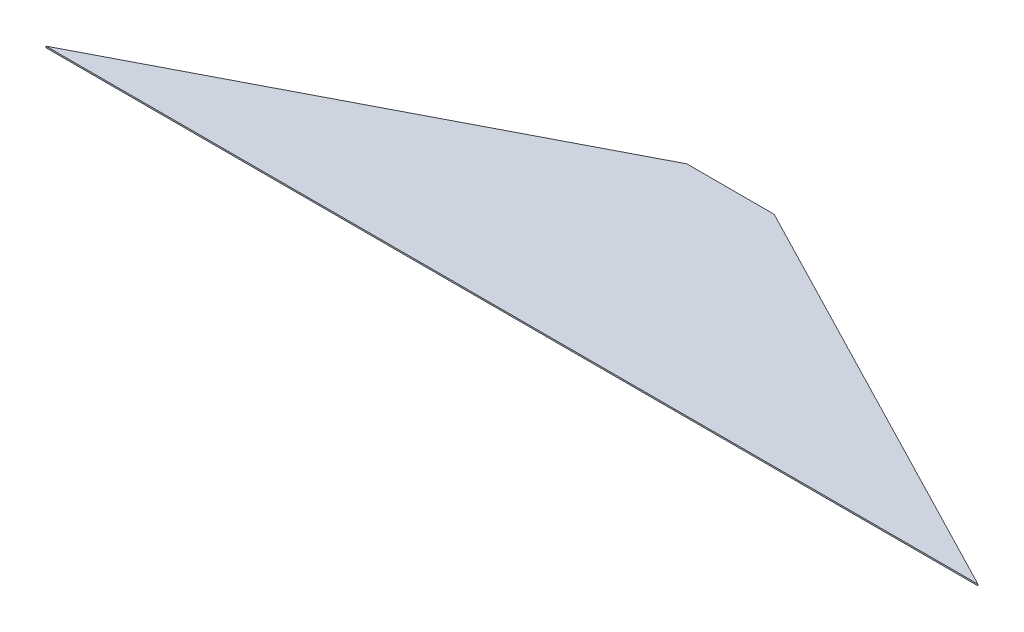
ISO-10303-21;
HEADER;
FILE_DESCRIPTION(('STEP AP214'),'2;1');
FILE_NAME('part.step','',(''),(''),'','','');
FILE_SCHEMA(('AUTOMOTIVE_DESIGN { 1 0 10303 214 1 1 1 1 }'));
ENDSEC;
DATA;
#1=APPLICATION_CONTEXT('core data for automotive mechanical design processes');
#2=APPLICATION_PROTOCOL_DEFINITION('international standard','automotive_design',2000,#1);
#3=PRODUCT_CONTEXT('',#1,'mechanical');
#4=PRODUCT('Part','Part','',(#3));
#5=PRODUCT_RELATED_PRODUCT_CATEGORY('part','',(#4));
#6=PRODUCT_DEFINITION_FORMATION('','',#4);
#7=PRODUCT_DEFINITION_CONTEXT('part definition',#1,'design');
#8=PRODUCT_DEFINITION('design','',#6,#7);
#9=PRODUCT_DEFINITION_SHAPE('','',#8);
#10=(LENGTH_UNIT() NAMED_UNIT(*) SI_UNIT(.MILLI.,.METRE.));
#11=(NAMED_UNIT(*) PLANE_ANGLE_UNIT() SI_UNIT($,.RADIAN.));
#12=(NAMED_UNIT(*) SI_UNIT($,.STERADIAN.) SOLID_ANGLE_UNIT());
#13=UNCERTAINTY_MEASURE_WITH_UNIT(LENGTH_MEASURE(1.E-05),#10,'distance_accuracy_value','');
#14=(GEOMETRIC_REPRESENTATION_CONTEXT(3) GLOBAL_UNCERTAINTY_ASSIGNED_CONTEXT((#13)) GLOBAL_UNIT_ASSIGNED_CONTEXT((#10,
#11,#12)) REPRESENTATION_CONTEXT('',''));
#15=CARTESIAN_POINT('',(0.,0.,0.));
#16=DIRECTION('',(0.,0.,1.));
#17=DIRECTION('',(1.,0.,0.));
#18=AXIS2_PLACEMENT_3D('',#15,#16,#17);
#19=CARTESIAN_POINT('',(290.,1.,-150.));
#20=DIRECTION('',(0.459422918873767,0.,0.888217643155949));
#21=DIRECTION('',(0.888217643155949,0.,-0.459422918873767));
#22=AXIS2_PLACEMENT_3D('',#19,#20,#21);
#23=PLANE('',#22);
#24=DIRECTION('',(-0.888217643155949,0.,0.459422918873767));
#25=VECTOR('',#24,1.);
#26=CARTESIAN_POINT('',(290.,0.,-150.));
#27=LINE('',#26,#25);
#28=CARTESIAN_POINT('',(290.,0.,-150.));
#29=VERTEX_POINT('',#28);
#30=CARTESIAN_POINT('',(0.,0.,0.));
#31=VERTEX_POINT('',#30);
#32=EDGE_CURVE('E107',#29,#31,#27,.T.);
#33=ORIENTED_EDGE('',*,*,#32,.T.);
#34=DIRECTION('',(0.,-1.,0.));
#35=VECTOR('',#34,1.);
#36=CARTESIAN_POINT('',(0.,1.,0.));
#37=LINE('',#36,#35);
#38=CARTESIAN_POINT('',(0.,1.,0.));
#39=VERTEX_POINT('',#38);
#40=EDGE_CURVE('E11',#39,#31,#37,.T.);
#41=ORIENTED_EDGE('',*,*,#40,.F.);
#42=DIRECTION('',(-0.888217643155949,0.,0.459422918873767));
#43=VECTOR('',#42,1.);
#44=CARTESIAN_POINT('',(290.,1.,-150.));
#45=LINE('',#44,#43);
#46=CARTESIAN_POINT('',(290.,1.,-150.));
#47=VERTEX_POINT('',#46);
#48=EDGE_CURVE('E91',#47,#39,#45,.T.);
#49=ORIENTED_EDGE('',*,*,#48,.F.);
#50=DIRECTION('',(0.,-1.,0.));
#51=VECTOR('',#50,1.);
#52=CARTESIAN_POINT('',(290.,1.,-150.));
#53=LINE('',#52,#51);
#54=EDGE_CURVE('E103',#47,#29,#53,.T.);
#55=ORIENTED_EDGE('',*,*,#54,.T.);
#56=EDGE_LOOP('',(#33,#41,#49,#55));
#57=FACE_BOUND('',#56,.T.);
#58=ADVANCED_FACE('F39',(#57),#23,.F.);
#59=CARTESIAN_POINT('',(0.,1.,0.));
#60=DIRECTION('',(0.,0.,-1.));
#61=DIRECTION('',(-1.,0.,0.));
#62=AXIS2_PLACEMENT_3D('',#59,#60,#61);
#63=PLANE('',#62);
#64=DIRECTION('',(1.,0.,0.));
#65=VECTOR('',#64,1.);
#66=CARTESIAN_POINT('',(0.,0.,0.));
#67=LINE('',#66,#65);
#68=CARTESIAN_POINT('',(640.,0.,0.));
#69=VERTEX_POINT('',#68);
#70=EDGE_CURVE('E96',#31,#69,#67,.T.);
#71=ORIENTED_EDGE('',*,*,#70,.T.);
#72=DIRECTION('',(0.,-1.,0.));
#73=VECTOR('',#72,1.);
#74=CARTESIAN_POINT('',(640.,1.,0.));
#75=LINE('',#74,#73);
#76=CARTESIAN_POINT('',(640.,1.,0.));
#77=VERTEX_POINT('',#76);
#78=EDGE_CURVE('E48',#77,#69,#75,.T.);
#79=ORIENTED_EDGE('',*,*,#78,.F.);
#80=DIRECTION('',(1.,0.,0.));
#81=VECTOR('',#80,1.);
#82=CARTESIAN_POINT('',(0.,1.,0.));
#83=LINE('',#82,#81);
#84=EDGE_CURVE('E86',#39,#77,#83,.T.);
#85=ORIENTED_EDGE('',*,*,#84,.F.);
#86=ORIENTED_EDGE('',*,*,#40,.T.);
#87=EDGE_LOOP('',(#71,#79,#85,#86));
#88=FACE_BOUND('',#87,.T.);
#89=ADVANCED_FACE('F95',(#88),#63,.F.);
#90=CARTESIAN_POINT('',(640.,1.,0.));
#91=DIRECTION('',(-0.459422918873767,0.,0.888217643155949));
#92=DIRECTION('',(0.888217643155949,0.,0.459422918873767));
#93=AXIS2_PLACEMENT_3D('',#90,#91,#92);
#94=PLANE('',#93);
#95=DIRECTION('',(-0.888217643155949,0.,-0.459422918873767));
#96=VECTOR('',#95,1.);
#97=CARTESIAN_POINT('',(640.,0.,0.));
#98=LINE('',#97,#96);
#99=CARTESIAN_POINT('',(350.,0.,-150.));
#100=VERTEX_POINT('',#99);
#101=EDGE_CURVE('E73',#69,#100,#98,.T.);
#102=ORIENTED_EDGE('',*,*,#101,.T.);
#103=DIRECTION('',(0.,-1.,0.));
#104=VECTOR('',#103,1.);
#105=CARTESIAN_POINT('',(350.,1.,-150.));
#106=LINE('',#105,#104);
#107=CARTESIAN_POINT('',(350.,1.,-150.));
#108=VERTEX_POINT('',#107);
#109=EDGE_CURVE('E98',#108,#100,#106,.T.);
#110=ORIENTED_EDGE('',*,*,#109,.F.);
#111=DIRECTION('',(-0.888217643155949,0.,-0.459422918873767));
#112=VECTOR('',#111,1.);
#113=CARTESIAN_POINT('',(640.,1.,0.));
#114=LINE('',#113,#112);
#115=EDGE_CURVE('E89',#77,#108,#114,.T.);
#116=ORIENTED_EDGE('',*,*,#115,.F.);
#117=ORIENTED_EDGE('',*,*,#78,.T.);
#118=EDGE_LOOP('',(#102,#110,#116,#117));
#119=FACE_BOUND('',#118,.T.);
#120=ADVANCED_FACE('F99',(#119),#94,.F.);
#121=CARTESIAN_POINT('',(350.,1.,-150.));
#122=DIRECTION('',(0.,0.,1.));
#123=DIRECTION('',(1.,0.,0.));
#124=AXIS2_PLACEMENT_3D('',#121,#122,#123);
#125=PLANE('',#124);
#126=DIRECTION('',(-1.,0.,0.));
#127=VECTOR('',#126,1.);
#128=CARTESIAN_POINT('',(350.,0.,-150.));
#129=LINE('',#128,#127);
#130=EDGE_CURVE('E79',#100,#29,#129,.T.);
#131=ORIENTED_EDGE('',*,*,#130,.T.);
#132=ORIENTED_EDGE('',*,*,#54,.F.);
#133=DIRECTION('',(-1.,0.,0.));
#134=VECTOR('',#133,1.);
#135=CARTESIAN_POINT('',(350.,1.,-150.));
#136=LINE('',#135,#134);
#137=EDGE_CURVE('E56',#108,#47,#136,.T.);
#138=ORIENTED_EDGE('',*,*,#137,.F.);
#139=ORIENTED_EDGE('',*,*,#109,.T.);
#140=EDGE_LOOP('',(#131,#132,#138,#139));
#141=FACE_BOUND('',#140,.T.);
#142=ADVANCED_FACE('F120',(#141),#125,.F.);
#143=CARTESIAN_POINT('',(0.,1.,0.));
#144=DIRECTION('',(0.,-1.,0.));
#145=DIRECTION('',(0.,0.,-1.));
#146=AXIS2_PLACEMENT_3D('',#143,#144,#145);
#147=PLANE('',#146);
#148=ORIENTED_EDGE('',*,*,#48,.T.);
#149=ORIENTED_EDGE('',*,*,#84,.T.);
#150=ORIENTED_EDGE('',*,*,#115,.T.);
#151=ORIENTED_EDGE('',*,*,#137,.T.);
#152=EDGE_LOOP('',(#148,#149,#150,#151));
#153=FACE_BOUND('',#152,.T.);
#154=ADVANCED_FACE('F87',(#153),#147,.F.);
#155=CARTESIAN_POINT('',(0.,0.,0.));
#156=DIRECTION('',(0.,-1.,0.));
#157=DIRECTION('',(0.,0.,-1.));
#158=AXIS2_PLACEMENT_3D('',#155,#156,#157);
#159=PLANE('',#158);
#160=ORIENTED_EDGE('',*,*,#32,.F.);
#161=ORIENTED_EDGE('',*,*,#130,.F.);
#162=ORIENTED_EDGE('',*,*,#101,.F.);
#163=ORIENTED_EDGE('',*,*,#70,.F.);
#164=EDGE_LOOP('',(#160,#161,#162,#163));
#165=FACE_BOUND('',#164,.T.);
#166=ADVANCED_FACE('F123',(#165),#159,.T.);
#167=CLOSED_SHELL('',(#58,#89,#120,#142,#154,#166));
#168=MANIFOLD_SOLID_BREP('B2',#167);
#169=ADVANCED_BREP_SHAPE_REPRESENTATION('',(#18,#168),#14);
#170=SHAPE_DEFINITION_REPRESENTATION(#9,#169);
ENDSEC;
END-ISO-10303-21;
